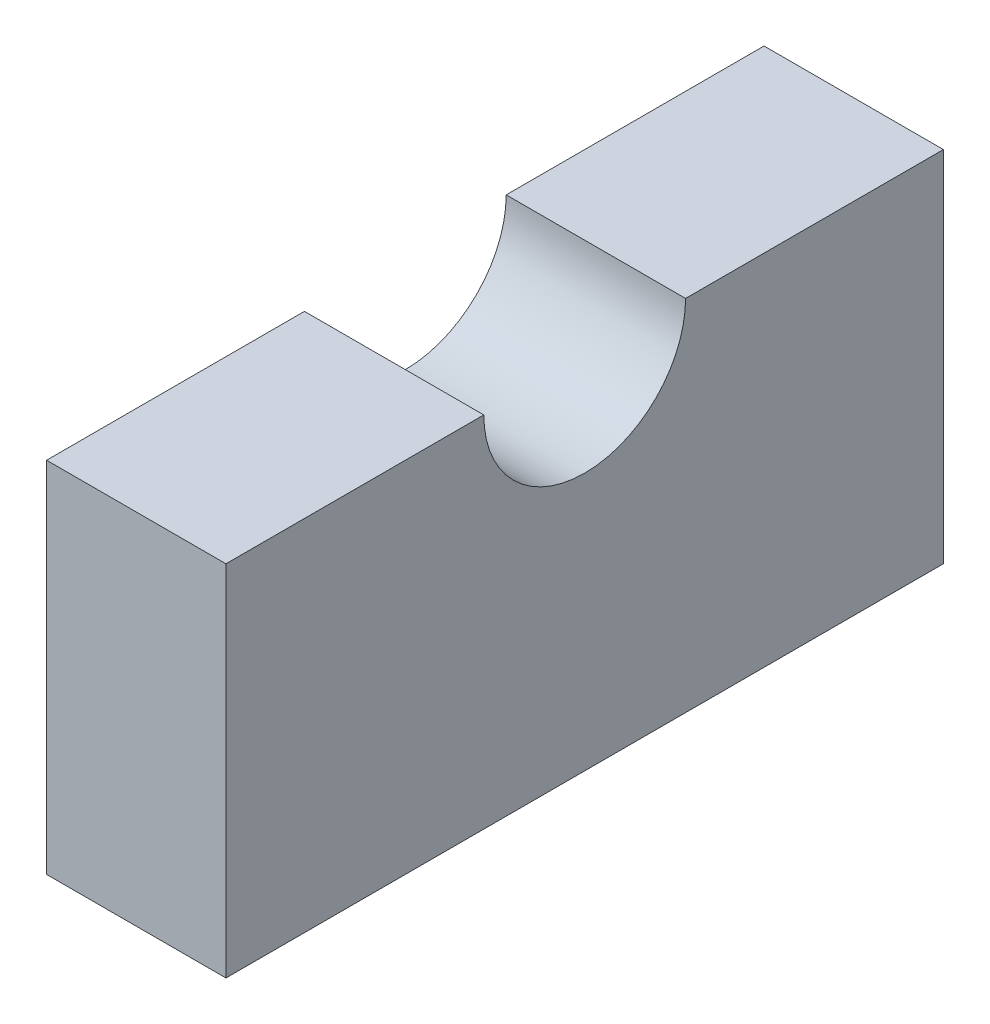
ISO-10303-21;
HEADER;
FILE_DESCRIPTION(('STEP AP214'),'2;1');
FILE_NAME('part.step','',(''),(''),'','','');
FILE_SCHEMA(('AUTOMOTIVE_DESIGN { 1 0 10303 214 1 1 1 1 }'));
ENDSEC;
DATA;
#1=APPLICATION_CONTEXT('core data for automotive mechanical design processes');
#2=APPLICATION_PROTOCOL_DEFINITION('international standard','automotive_design',2000,#1);
#3=PRODUCT_CONTEXT('',#1,'mechanical');
#4=PRODUCT('Part','Part','',(#3));
#5=PRODUCT_RELATED_PRODUCT_CATEGORY('part','',(#4));
#6=PRODUCT_DEFINITION_FORMATION('','',#4);
#7=PRODUCT_DEFINITION_CONTEXT('part definition',#1,'design');
#8=PRODUCT_DEFINITION('design','',#6,#7);
#9=PRODUCT_DEFINITION_SHAPE('','',#8);
#10=(LENGTH_UNIT() NAMED_UNIT(*) SI_UNIT(.MILLI.,.METRE.));
#11=(NAMED_UNIT(*) PLANE_ANGLE_UNIT() SI_UNIT($,.RADIAN.));
#12=(NAMED_UNIT(*) SI_UNIT($,.STERADIAN.) SOLID_ANGLE_UNIT());
#13=UNCERTAINTY_MEASURE_WITH_UNIT(LENGTH_MEASURE(1.E-05),#10,'distance_accuracy_value','');
#14=(GEOMETRIC_REPRESENTATION_CONTEXT(3) GLOBAL_UNCERTAINTY_ASSIGNED_CONTEXT((#13)) GLOBAL_UNIT_ASSIGNED_CONTEXT((#10,
#11,#12)) REPRESENTATION_CONTEXT('',''));
#15=CARTESIAN_POINT('',(0.,0.,0.));
#16=DIRECTION('',(0.,0.,1.));
#17=DIRECTION('',(1.,0.,0.));
#18=AXIS2_PLACEMENT_3D('',#15,#16,#17);
#19=CARTESIAN_POINT('',(12.7,0.,50.8));
#20=DIRECTION('',(0.,0.,-1.));
#21=DIRECTION('',(0.,1.,0.));
#22=AXIS2_PLACEMENT_3D('',#19,#20,#21);
#23=PLANE('',#22);
#24=DIRECTION('',(0.,-1.,0.));
#25=VECTOR('',#24,1.);
#26=CARTESIAN_POINT('',(-12.7,0.,50.8));
#27=LINE('',#26,#25);
#28=CARTESIAN_POINT('',(-12.7,50.8,50.8));
#29=VERTEX_POINT('',#28);
#30=CARTESIAN_POINT('',(-12.7,0.,50.8));
#31=VERTEX_POINT('',#30);
#32=EDGE_CURVE('E132',#29,#31,#27,.T.);
#33=ORIENTED_EDGE('',*,*,#32,.T.);
#34=DIRECTION('',(-1.,0.,0.));
#35=VECTOR('',#34,1.);
#36=CARTESIAN_POINT('',(12.7,0.,50.8));
#37=LINE('',#36,#35);
#38=CARTESIAN_POINT('',(12.7,0.,50.8));
#39=VERTEX_POINT('',#38);
#40=EDGE_CURVE('E11',#39,#31,#37,.T.);
#41=ORIENTED_EDGE('',*,*,#40,.F.);
#42=DIRECTION('',(0.,-1.,0.));
#43=VECTOR('',#42,1.);
#44=CARTESIAN_POINT('',(12.7,0.,50.8));
#45=LINE('',#44,#43);
#46=CARTESIAN_POINT('',(12.7,50.8,50.8));
#47=VERTEX_POINT('',#46);
#48=EDGE_CURVE('E148',#47,#39,#45,.T.);
#49=ORIENTED_EDGE('',*,*,#48,.F.);
#50=DIRECTION('',(-1.,0.,0.));
#51=VECTOR('',#50,1.);
#52=CARTESIAN_POINT('',(12.7,50.8,50.8));
#53=LINE('',#52,#51);
#54=EDGE_CURVE('E128',#47,#29,#53,.T.);
#55=ORIENTED_EDGE('',*,*,#54,.T.);
#56=EDGE_LOOP('',(#33,#41,#49,#55));
#57=FACE_BOUND('',#56,.T.);
#58=ADVANCED_FACE('F43',(#57),#23,.F.);
#59=CARTESIAN_POINT('',(12.7,0.,50.8));
#60=DIRECTION('',(0.,1.,0.));
#61=DIRECTION('',(0.,0.,1.));
#62=AXIS2_PLACEMENT_3D('',#59,#60,#61);
#63=PLANE('',#62);
#64=DIRECTION('',(0.,0.,-1.));
#65=VECTOR('',#64,1.);
#66=CARTESIAN_POINT('',(-12.7,0.,50.8));
#67=LINE('',#66,#65);
#68=CARTESIAN_POINT('',(-12.7,0.,-50.8));
#69=VERTEX_POINT('',#68);
#70=EDGE_CURVE('E136',#31,#69,#67,.T.);
#71=ORIENTED_EDGE('',*,*,#70,.T.);
#72=DIRECTION('',(-1.,0.,0.));
#73=VECTOR('',#72,1.);
#74=CARTESIAN_POINT('',(12.7,0.,-50.8));
#75=LINE('',#74,#73);
#76=CARTESIAN_POINT('',(12.7,0.,-50.8));
#77=VERTEX_POINT('',#76);
#78=EDGE_CURVE('E52',#77,#69,#75,.T.);
#79=ORIENTED_EDGE('',*,*,#78,.F.);
#80=DIRECTION('',(0.,0.,-1.));
#81=VECTOR('',#80,1.);
#82=CARTESIAN_POINT('',(12.7,0.,50.8));
#83=LINE('',#82,#81);
#84=EDGE_CURVE('E97',#39,#77,#83,.T.);
#85=ORIENTED_EDGE('',*,*,#84,.F.);
#86=ORIENTED_EDGE('',*,*,#40,.T.);
#87=EDGE_LOOP('',(#71,#79,#85,#86));
#88=FACE_BOUND('',#87,.T.);
#89=ADVANCED_FACE('F176',(#88),#63,.F.);
#90=CARTESIAN_POINT('',(12.7,0.,-50.8));
#91=DIRECTION('',(0.,0.,1.));
#92=DIRECTION('',(1.,0.,0.));
#93=AXIS2_PLACEMENT_3D('',#90,#91,#92);
#94=PLANE('',#93);
#95=DIRECTION('',(0.,1.,0.));
#96=VECTOR('',#95,1.);
#97=CARTESIAN_POINT('',(-12.7,0.,-50.8));
#98=LINE('',#97,#96);
#99=CARTESIAN_POINT('',(-12.7,50.8,-50.8));
#100=VERTEX_POINT('',#99);
#101=EDGE_CURVE('E139',#69,#100,#98,.T.);
#102=ORIENTED_EDGE('',*,*,#101,.T.);
#103=DIRECTION('',(-1.,0.,0.));
#104=VECTOR('',#103,1.);
#105=CARTESIAN_POINT('',(12.7,50.8,-50.8));
#106=LINE('',#105,#104);
#107=CARTESIAN_POINT('',(12.7,50.8,-50.8));
#108=VERTEX_POINT('',#107);
#109=EDGE_CURVE('E121',#108,#100,#106,.T.);
#110=ORIENTED_EDGE('',*,*,#109,.F.);
#111=DIRECTION('',(0.,1.,0.));
#112=VECTOR('',#111,1.);
#113=CARTESIAN_POINT('',(12.7,0.,-50.8));
#114=LINE('',#113,#112);
#115=EDGE_CURVE('E110',#77,#108,#114,.T.);
#116=ORIENTED_EDGE('',*,*,#115,.F.);
#117=ORIENTED_EDGE('',*,*,#78,.T.);
#118=EDGE_LOOP('',(#102,#110,#116,#117));
#119=FACE_BOUND('',#118,.T.);
#120=ADVANCED_FACE('F158',(#119),#94,.F.);
#121=CARTESIAN_POINT('',(12.7,50.8,-14.2875));
#122=DIRECTION('',(0.,-1.,0.));
#123=DIRECTION('',(0.,0.,-1.));
#124=AXIS2_PLACEMENT_3D('',#121,#122,#123);
#125=PLANE('',#124);
#126=DIRECTION('',(0.,0.,1.));
#127=VECTOR('',#126,1.);
#128=CARTESIAN_POINT('',(-12.7,50.8,-14.2875));
#129=LINE('',#128,#127);
#130=CARTESIAN_POINT('',(-12.7,50.8,-14.2875));
#131=VERTEX_POINT('',#130);
#132=EDGE_CURVE('E119',#100,#131,#129,.T.);
#133=ORIENTED_EDGE('',*,*,#132,.T.);
#134=DIRECTION('',(-1.,0.,0.));
#135=VECTOR('',#134,1.);
#136=CARTESIAN_POINT('',(12.7,50.8,-14.2875));
#137=LINE('',#136,#135);
#138=CARTESIAN_POINT('',(12.7,50.8,-14.2875));
#139=VERTEX_POINT('',#138);
#140=EDGE_CURVE('E116',#139,#131,#137,.T.);
#141=ORIENTED_EDGE('',*,*,#140,.F.);
#142=DIRECTION('',(0.,0.,1.));
#143=VECTOR('',#142,1.);
#144=CARTESIAN_POINT('',(12.7,50.8,-14.2875));
#145=LINE('',#144,#143);
#146=EDGE_CURVE('E104',#108,#139,#145,.T.);
#147=ORIENTED_EDGE('',*,*,#146,.F.);
#148=ORIENTED_EDGE('',*,*,#109,.T.);
#149=EDGE_LOOP('',(#133,#141,#147,#148));
#150=FACE_BOUND('',#149,.T.);
#151=ADVANCED_FACE('F117',(#150),#125,.F.);
#152=CARTESIAN_POINT('',(12.7,50.8,0.));
#153=DIRECTION('',(-1.,0.,0.));
#154=DIRECTION('',(0.,0.,1.));
#155=AXIS2_PLACEMENT_3D('',#152,#153,#154);
#156=CYLINDRICAL_SURFACE('',#155,14.2875);
#157=CARTESIAN_POINT('',(-12.7,50.8,0.));
#158=DIRECTION('',(-1.,0.,0.));
#159=DIRECTION('',(0.,0.,-1.));
#160=AXIS2_PLACEMENT_3D('',#157,#158,#159);
#161=CIRCLE('',#160,14.2875);
#162=CARTESIAN_POINT('',(-12.7,50.8,14.2875));
#163=VERTEX_POINT('',#162);
#164=EDGE_CURVE('E83',#131,#163,#161,.T.);
#165=ORIENTED_EDGE('',*,*,#164,.T.);
#166=DIRECTION('',(-1.,0.,0.));
#167=VECTOR('',#166,1.);
#168=CARTESIAN_POINT('',(12.7,50.8,14.2875));
#169=LINE('',#168,#167);
#170=CARTESIAN_POINT('',(12.7,50.8,14.2875));
#171=VERTEX_POINT('',#170);
#172=EDGE_CURVE('E122',#171,#163,#169,.T.);
#173=ORIENTED_EDGE('',*,*,#172,.F.);
#174=CARTESIAN_POINT('',(12.7,50.8,0.));
#175=DIRECTION('',(-1.,0.,0.));
#176=DIRECTION('',(0.,0.,-1.));
#177=AXIS2_PLACEMENT_3D('',#174,#175,#176);
#178=CIRCLE('',#177,14.2875);
#179=EDGE_CURVE('E108',#139,#171,#178,.T.);
#180=ORIENTED_EDGE('',*,*,#179,.F.);
#181=ORIENTED_EDGE('',*,*,#140,.T.);
#182=EDGE_LOOP('',(#165,#173,#180,#181));
#183=FACE_BOUND('',#182,.T.);
#184=ADVANCED_FACE('F124',(#183),#156,.F.);
#185=CARTESIAN_POINT('',(12.7,50.8,50.8));
#186=DIRECTION('',(0.,-1.,0.));
#187=DIRECTION('',(0.,0.,-1.));
#188=AXIS2_PLACEMENT_3D('',#185,#186,#187);
#189=PLANE('',#188);
#190=DIRECTION('',(0.,0.,1.));
#191=VECTOR('',#190,1.);
#192=CARTESIAN_POINT('',(-12.7,50.8,50.8));
#193=LINE('',#192,#191);
#194=EDGE_CURVE('E89',#163,#29,#193,.T.);
#195=ORIENTED_EDGE('',*,*,#194,.T.);
#196=ORIENTED_EDGE('',*,*,#54,.F.);
#197=DIRECTION('',(0.,0.,1.));
#198=VECTOR('',#197,1.);
#199=CARTESIAN_POINT('',(12.7,50.8,50.8));
#200=LINE('',#199,#198);
#201=EDGE_CURVE('E60',#171,#47,#200,.T.);
#202=ORIENTED_EDGE('',*,*,#201,.F.);
#203=ORIENTED_EDGE('',*,*,#172,.T.);
#204=EDGE_LOOP('',(#195,#196,#202,#203));
#205=FACE_BOUND('',#204,.T.);
#206=ADVANCED_FACE('F165',(#205),#189,.F.);
#207=CARTESIAN_POINT('',(12.7,50.8,0.));
#208=DIRECTION('',(1.,0.,0.));
#209=DIRECTION('',(0.,0.,-1.));
#210=AXIS2_PLACEMENT_3D('',#207,#208,#209);
#211=PLANE('',#210);
#212=ORIENTED_EDGE('',*,*,#48,.T.);
#213=ORIENTED_EDGE('',*,*,#84,.T.);
#214=ORIENTED_EDGE('',*,*,#115,.T.);
#215=ORIENTED_EDGE('',*,*,#146,.T.);
#216=ORIENTED_EDGE('',*,*,#179,.T.);
#217=ORIENTED_EDGE('',*,*,#201,.T.);
#218=EDGE_LOOP('',(#212,#213,#214,#215,#216,#217));
#219=FACE_BOUND('',#218,.T.);
#220=ADVANCED_FACE('F106',(#219),#211,.T.);
#221=CARTESIAN_POINT('',(-12.7,50.8,0.));
#222=DIRECTION('',(1.,0.,0.));
#223=DIRECTION('',(0.,0.,-1.));
#224=AXIS2_PLACEMENT_3D('',#221,#222,#223);
#225=PLANE('',#224);
#226=ORIENTED_EDGE('',*,*,#32,.F.);
#227=ORIENTED_EDGE('',*,*,#194,.F.);
#228=ORIENTED_EDGE('',*,*,#164,.F.);
#229=ORIENTED_EDGE('',*,*,#132,.F.);
#230=ORIENTED_EDGE('',*,*,#101,.F.);
#231=ORIENTED_EDGE('',*,*,#70,.F.);
#232=EDGE_LOOP('',(#226,#227,#228,#229,#230,#231));
#233=FACE_BOUND('',#232,.T.);
#234=ADVANCED_FACE('F161',(#233),#225,.F.);
#235=CLOSED_SHELL('',(#58,#89,#120,#151,#184,#206,#220,#234));
#236=MANIFOLD_SOLID_BREP('B2',#235);
#237=ADVANCED_BREP_SHAPE_REPRESENTATION('',(#18,#236),#14);
#238=SHAPE_DEFINITION_REPRESENTATION(#9,#237);
ENDSEC;
END-ISO-10303-21;
